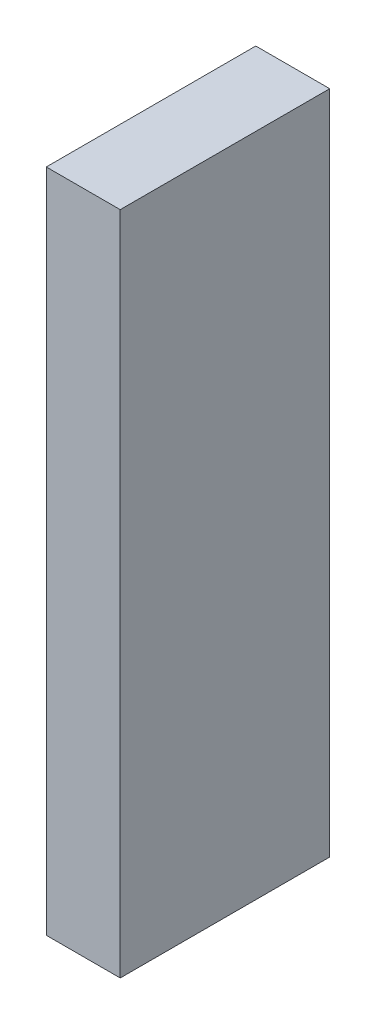
ISO-10303-21;
HEADER;
FILE_DESCRIPTION(('STEP AP214'),'2;1');
FILE_NAME('part.step','',(''),(''),'','','');
FILE_SCHEMA(('AUTOMOTIVE_DESIGN { 1 0 10303 214 1 1 1 1 }'));
ENDSEC;
DATA;
#1=APPLICATION_CONTEXT('core data for automotive mechanical design processes');
#2=APPLICATION_PROTOCOL_DEFINITION('international standard','automotive_design',2000,#1);
#3=PRODUCT_CONTEXT('',#1,'mechanical');
#4=PRODUCT('Part','Part','',(#3));
#5=PRODUCT_RELATED_PRODUCT_CATEGORY('part','',(#4));
#6=PRODUCT_DEFINITION_FORMATION('','',#4);
#7=PRODUCT_DEFINITION_CONTEXT('part definition',#1,'design');
#8=PRODUCT_DEFINITION('design','',#6,#7);
#9=PRODUCT_DEFINITION_SHAPE('','',#8);
#10=(LENGTH_UNIT() NAMED_UNIT(*) SI_UNIT(.MILLI.,.METRE.));
#11=(NAMED_UNIT(*) PLANE_ANGLE_UNIT() SI_UNIT($,.RADIAN.));
#12=(NAMED_UNIT(*) SI_UNIT($,.STERADIAN.) SOLID_ANGLE_UNIT());
#13=UNCERTAINTY_MEASURE_WITH_UNIT(LENGTH_MEASURE(1.E-05),#10,'distance_accuracy_value','');
#14=(GEOMETRIC_REPRESENTATION_CONTEXT(3) GLOBAL_UNCERTAINTY_ASSIGNED_CONTEXT((#13)) GLOBAL_UNIT_ASSIGNED_CONTEXT((#10,
#11,#12)) REPRESENTATION_CONTEXT('',''));
#15=CARTESIAN_POINT('',(0.,0.,0.));
#16=DIRECTION('',(0.,0.,1.));
#17=DIRECTION('',(1.,0.,0.));
#18=AXIS2_PLACEMENT_3D('',#15,#16,#17);
#19=CARTESIAN_POINT('',(-3.04999789842071,2.69998251018302,0.));
#20=DIRECTION('',(-1.,1.19248806385031E-08,0.));
#21=DIRECTION('',(-1.19248806385031E-08,-1.,0.));
#22=AXIS2_PLACEMENT_3D('',#19,#20,#21);
#23=PLANE('',#22);
#24=DIRECTION('',(-1.19248806627069E-08,-1.,0.));
#25=VECTOR('',#24,1.);
#26=CARTESIAN_POINT('',(-3.04999789842071,2.69998251018302,0.));
#27=LINE('',#26,#25);
#28=CARTESIAN_POINT('',(-3.04999789842071,2.69998251018302,0.));
#29=VERTEX_POINT('',#28);
#30=CARTESIAN_POINT('',(-3.049997962815,-2.70001138630136,0.));
#31=VERTEX_POINT('',#30);
#32=EDGE_CURVE('E11',#29,#31,#27,.T.);
#33=ORIENTED_EDGE('',*,*,#32,.T.);
#34=DIRECTION('',(0.,0.,1.));
#35=VECTOR('',#34,1.);
#36=CARTESIAN_POINT('',(-3.049997962815,-2.70001138630136,0.));
#37=LINE('',#36,#35);
#38=CARTESIAN_POINT('',(-3.049997962815,-2.70001138630136,1.6999990940094));
#39=VERTEX_POINT('',#38);
#40=EDGE_CURVE('E88',#31,#39,#37,.T.);
#41=ORIENTED_EDGE('',*,*,#40,.T.);
#42=DIRECTION('',(-1.19248806627069E-08,-1.,0.));
#43=VECTOR('',#42,1.);
#44=CARTESIAN_POINT('',(-3.04999789842071,2.69998251018302,1.6999990940094));
#45=LINE('',#44,#43);
#46=CARTESIAN_POINT('',(-3.04999789842071,2.69998251018302,1.6999990940094));
#47=VERTEX_POINT('',#46);
#48=EDGE_CURVE('E83',#47,#39,#45,.T.);
#49=ORIENTED_EDGE('',*,*,#48,.F.);
#50=DIRECTION('',(0.,0.,1.));
#51=VECTOR('',#50,1.);
#52=CARTESIAN_POINT('',(-3.04999789842071,2.69998251018299,0.));
#53=LINE('',#52,#51);
#54=EDGE_CURVE('E72',#29,#47,#53,.T.);
#55=ORIENTED_EDGE('',*,*,#54,.F.);
#56=EDGE_LOOP('',(#33,#41,#49,#55));
#57=FACE_BOUND('',#56,.T.);
#58=ADVANCED_FACE('F17',(#57),#23,.T.);
#59=CARTESIAN_POINT('',(-3.049997962815,-2.70001138630136,0.));
#60=DIRECTION('',(-1.19248806385031E-08,-1.,0.));
#61=DIRECTION('',(1.,-1.19248806385031E-08,0.));
#62=AXIS2_PLACEMENT_3D('',#59,#60,#61);
#63=PLANE('',#62);
#64=DIRECTION('',(1.,-1.19248803228865E-08,0.));
#65=VECTOR('',#64,1.);
#66=CARTESIAN_POINT('',(-3.049997962815,-2.70001138630136,0.));
#67=LINE('',#66,#65);
#68=CARTESIAN_POINT('',(-2.4499994886939,-2.70001139345629,0.));
#69=VERTEX_POINT('',#68);
#70=EDGE_CURVE('E24',#31,#69,#67,.T.);
#71=ORIENTED_EDGE('',*,*,#70,.T.);
#72=DIRECTION('',(0.,0.,1.));
#73=VECTOR('',#72,1.);
#74=CARTESIAN_POINT('',(-2.4499994886939,-2.70001139345627,0.));
#75=LINE('',#74,#73);
#76=CARTESIAN_POINT('',(-2.4499994886939,-2.70001139345629,1.6999990940094));
#77=VERTEX_POINT('',#76);
#78=EDGE_CURVE('E85',#69,#77,#75,.T.);
#79=ORIENTED_EDGE('',*,*,#78,.T.);
#80=DIRECTION('',(1.,-1.19248803228865E-08,0.));
#81=VECTOR('',#80,1.);
#82=CARTESIAN_POINT('',(-3.049997962815,-2.70001138630136,1.6999990940094));
#83=LINE('',#82,#81);
#84=EDGE_CURVE('E66',#39,#77,#83,.T.);
#85=ORIENTED_EDGE('',*,*,#84,.F.);
#86=ORIENTED_EDGE('',*,*,#40,.F.);
#87=EDGE_LOOP('',(#71,#79,#85,#86));
#88=FACE_BOUND('',#87,.T.);
#89=ADVANCED_FACE('F89',(#88),#63,.T.);
#90=CARTESIAN_POINT('',(-2.4499994886939,-2.70001139345629,0.));
#91=DIRECTION('',(1.,-1.19248806385031E-08,0.));
#92=DIRECTION('',(1.19248806385031E-08,1.,0.));
#93=AXIS2_PLACEMENT_3D('',#90,#91,#92);
#94=PLANE('',#93);
#95=DIRECTION('',(1.19248806627069E-08,1.,0.));
#96=VECTOR('',#95,1.);
#97=CARTESIAN_POINT('',(-2.4499994886939,-2.70001139345629,0.));
#98=LINE('',#97,#96);
#99=CARTESIAN_POINT('',(-2.44999942429962,2.69998250302808,0.));
#100=VERTEX_POINT('',#99);
#101=EDGE_CURVE('E62',#69,#100,#98,.T.);
#102=ORIENTED_EDGE('',*,*,#101,.T.);
#103=DIRECTION('',(0.,0.,1.));
#104=VECTOR('',#103,1.);
#105=CARTESIAN_POINT('',(-2.44999942429962,2.69998250302808,0.));
#106=LINE('',#105,#104);
#107=CARTESIAN_POINT('',(-2.44999942429962,2.69998250302808,1.6999990940094));
#108=VERTEX_POINT('',#107);
#109=EDGE_CURVE('E55',#100,#108,#106,.T.);
#110=ORIENTED_EDGE('',*,*,#109,.T.);
#111=DIRECTION('',(1.19248806627069E-08,1.,0.));
#112=VECTOR('',#111,1.);
#113=CARTESIAN_POINT('',(-2.4499994886939,-2.70001139345629,1.6999990940094));
#114=LINE('',#113,#112);
#115=EDGE_CURVE('E59',#77,#108,#114,.T.);
#116=ORIENTED_EDGE('',*,*,#115,.F.);
#117=ORIENTED_EDGE('',*,*,#78,.F.);
#118=EDGE_LOOP('',(#102,#110,#116,#117));
#119=FACE_BOUND('',#118,.T.);
#120=ADVANCED_FACE('F57',(#119),#94,.T.);
#121=CARTESIAN_POINT('',(-2.44999942429962,2.69998250302808,0.));
#122=DIRECTION('',(1.19248806385031E-08,1.,0.));
#123=DIRECTION('',(-1.,1.19248806385031E-08,0.));
#124=AXIS2_PLACEMENT_3D('',#121,#122,#123);
#125=PLANE('',#124);
#126=DIRECTION('',(-1.,1.19248803228865E-08,0.));
#127=VECTOR('',#126,1.);
#128=CARTESIAN_POINT('',(-2.44999942429962,2.69998250302808,0.));
#129=LINE('',#128,#127);
#130=EDGE_CURVE('E65',#100,#29,#129,.T.);
#131=ORIENTED_EDGE('',*,*,#130,.T.);
#132=ORIENTED_EDGE('',*,*,#54,.T.);
#133=DIRECTION('',(-1.,1.19248803228865E-08,0.));
#134=VECTOR('',#133,1.);
#135=CARTESIAN_POINT('',(-2.44999942429962,2.69998250302808,1.6999990940094));
#136=LINE('',#135,#134);
#137=EDGE_CURVE('E70',#108,#47,#136,.T.);
#138=ORIENTED_EDGE('',*,*,#137,.F.);
#139=ORIENTED_EDGE('',*,*,#109,.F.);
#140=EDGE_LOOP('',(#131,#132,#138,#139));
#141=FACE_BOUND('',#140,.T.);
#142=ADVANCED_FACE('F71',(#141),#125,.T.);
#143=CARTESIAN_POINT('',(65.7749938964844,-429.450012207031,1.6999990940094));
#144=DIRECTION('',(0.,0.,1.));
#145=DIRECTION('',(1.19248806385031E-08,1.,0.));
#146=AXIS2_PLACEMENT_3D('',#143,#144,#145);
#147=PLANE('',#146);
#148=ORIENTED_EDGE('',*,*,#48,.T.);
#149=ORIENTED_EDGE('',*,*,#84,.T.);
#150=ORIENTED_EDGE('',*,*,#115,.T.);
#151=ORIENTED_EDGE('',*,*,#137,.T.);
#152=EDGE_LOOP('',(#148,#149,#150,#151));
#153=FACE_BOUND('',#152,.T.);
#154=ADVANCED_FACE('F76',(#153),#147,.T.);
#155=CARTESIAN_POINT('',(65.7749938964844,-429.450012207031,0.));
#156=DIRECTION('',(0.,0.,1.));
#157=DIRECTION('',(1.19248806385031E-08,1.,0.));
#158=AXIS2_PLACEMENT_3D('',#155,#156,#157);
#159=PLANE('',#158);
#160=ORIENTED_EDGE('',*,*,#130,.F.);
#161=ORIENTED_EDGE('',*,*,#101,.F.);
#162=ORIENTED_EDGE('',*,*,#70,.F.);
#163=ORIENTED_EDGE('',*,*,#32,.F.);
#164=EDGE_LOOP('',(#160,#161,#162,#163));
#165=FACE_BOUND('',#164,.T.);
#166=ADVANCED_FACE('F91',(#165),#159,.F.);
#167=CLOSED_SHELL('',(#58,#89,#120,#142,#154,#166));
#168=MANIFOLD_SOLID_BREP('B1',#167);
#169=ADVANCED_BREP_SHAPE_REPRESENTATION('',(#18,#168),#14);
#170=SHAPE_DEFINITION_REPRESENTATION(#9,#169);
ENDSEC;
END-ISO-10303-21;
